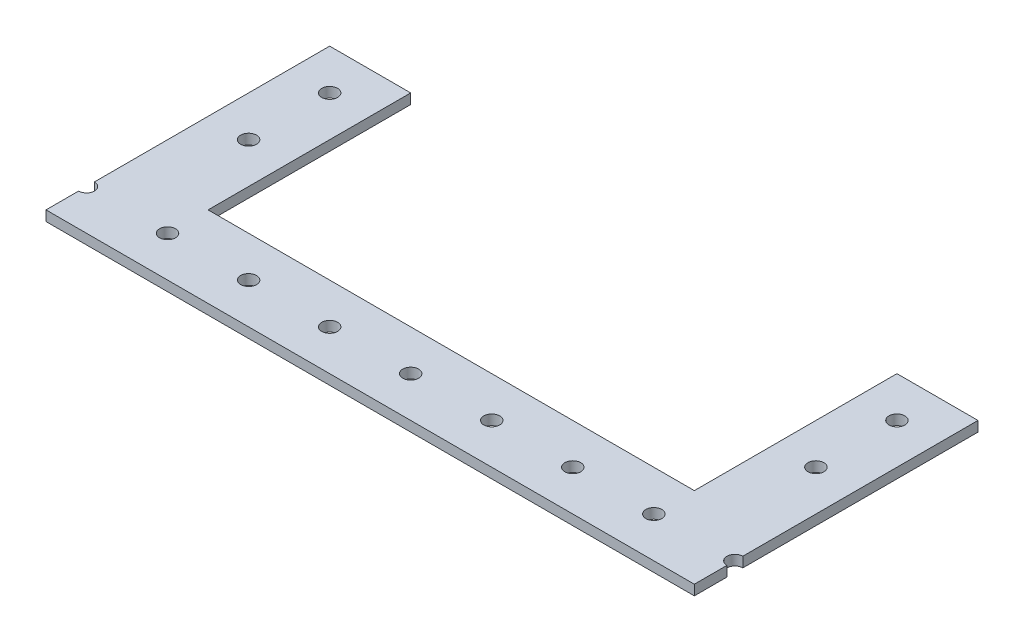
ISO-10303-21;
HEADER;
FILE_DESCRIPTION(('STEP AP214'),'2;1');
FILE_NAME('part.step','',(''),(''),'','','');
FILE_SCHEMA(('AUTOMOTIVE_DESIGN { 1 0 10303 214 1 1 1 1 }'));
ENDSEC;
DATA;
#1=APPLICATION_CONTEXT('core data for automotive mechanical design processes');
#2=APPLICATION_PROTOCOL_DEFINITION('international standard','automotive_design',2000,#1);
#3=PRODUCT_CONTEXT('',#1,'mechanical');
#4=PRODUCT('Part','Part','',(#3));
#5=PRODUCT_RELATED_PRODUCT_CATEGORY('part','',(#4));
#6=PRODUCT_DEFINITION_FORMATION('','',#4);
#7=PRODUCT_DEFINITION_CONTEXT('part definition',#1,'design');
#8=PRODUCT_DEFINITION('design','',#6,#7);
#9=PRODUCT_DEFINITION_SHAPE('','',#8);
#10=(LENGTH_UNIT() NAMED_UNIT(*) SI_UNIT(.MILLI.,.METRE.));
#11=(NAMED_UNIT(*) PLANE_ANGLE_UNIT() SI_UNIT($,.RADIAN.));
#12=(NAMED_UNIT(*) SI_UNIT($,.STERADIAN.) SOLID_ANGLE_UNIT());
#13=UNCERTAINTY_MEASURE_WITH_UNIT(LENGTH_MEASURE(1.E-05),#10,'distance_accuracy_value','');
#14=(GEOMETRIC_REPRESENTATION_CONTEXT(3) GLOBAL_UNCERTAINTY_ASSIGNED_CONTEXT((#13)) GLOBAL_UNIT_ASSIGNED_CONTEXT((#10,
#11,#12)) REPRESENTATION_CONTEXT('',''));
#15=CARTESIAN_POINT('',(0.,0.,0.));
#16=DIRECTION('',(0.,0.,1.));
#17=DIRECTION('',(1.,0.,0.));
#18=AXIS2_PLACEMENT_3D('',#15,#16,#17);
#19=CARTESIAN_POINT('',(101.6,3.175,-12.7));
#20=DIRECTION('',(0.,-1.,0.));
#21=DIRECTION('',(0.,0.,-1.));
#22=AXIS2_PLACEMENT_3D('',#19,#20,#21);
#23=CYLINDRICAL_SURFACE('',#22,2.48920000000003);
#24=CARTESIAN_POINT('',(101.6,0.,-12.7));
#25=DIRECTION('',(0.,1.,0.));
#26=DIRECTION('',(0.,0.,1.));
#27=AXIS2_PLACEMENT_3D('',#24,#25,#26);
#28=CIRCLE('',#27,2.48920000000003);
#29=CARTESIAN_POINT('',(101.6,0.,-15.1892));
#30=VERTEX_POINT('',#29);
#31=CARTESIAN_POINT('',(101.6,0.,-10.2108));
#32=VERTEX_POINT('',#31);
#33=EDGE_CURVE('E174',#30,#32,#28,.T.);
#34=ORIENTED_EDGE('',*,*,#33,.F.);
#35=DIRECTION('',(0.,-1.,0.));
#36=VECTOR('',#35,1.);
#37=CARTESIAN_POINT('',(101.6,3.175,-15.1892));
#38=LINE('',#37,#36);
#39=CARTESIAN_POINT('',(101.6,3.175,-15.1892));
#40=VERTEX_POINT('',#39);
#41=EDGE_CURVE('E11',#40,#30,#38,.T.);
#42=ORIENTED_EDGE('',*,*,#41,.F.);
#43=CARTESIAN_POINT('',(101.6,3.175,-12.7));
#44=DIRECTION('',(0.,1.,0.));
#45=DIRECTION('',(0.,0.,1.));
#46=AXIS2_PLACEMENT_3D('',#43,#44,#45);
#47=CIRCLE('',#46,2.48920000000003);
#48=CARTESIAN_POINT('',(101.6,3.175,-10.2108));
#49=VERTEX_POINT('',#48);
#50=EDGE_CURVE('E219',#40,#49,#47,.T.);
#51=ORIENTED_EDGE('',*,*,#50,.T.);
#52=DIRECTION('',(0.,-1.,0.));
#53=VECTOR('',#52,1.);
#54=CARTESIAN_POINT('',(101.6,3.175,-10.2108));
#55=LINE('',#54,#53);
#56=EDGE_CURVE('E97',#49,#32,#55,.T.);
#57=ORIENTED_EDGE('',*,*,#56,.T.);
#58=EDGE_LOOP('',(#34,#42,#51,#57));
#59=FACE_BOUND('',#58,.T.);
#60=ADVANCED_FACE('F34',(#59),#23,.F.);
#61=CARTESIAN_POINT('',(101.6,3.175,0.));
#62=DIRECTION('',(-1.,0.,0.));
#63=DIRECTION('',(0.,0.,1.));
#64=AXIS2_PLACEMENT_3D('',#61,#62,#63);
#65=PLANE('',#64);
#66=DIRECTION('',(0.,0.,-1.));
#67=VECTOR('',#66,1.);
#68=CARTESIAN_POINT('',(101.6,0.,0.));
#69=LINE('',#68,#67);
#70=CARTESIAN_POINT('',(101.6,0.,-88.9));
#71=VERTEX_POINT('',#70);
#72=EDGE_CURVE('E177',#30,#71,#69,.T.);
#73=ORIENTED_EDGE('',*,*,#72,.T.);
#74=DIRECTION('',(0.,-1.,0.));
#75=VECTOR('',#74,1.);
#76=CARTESIAN_POINT('',(101.6,3.175,-88.9));
#77=LINE('',#76,#75);
#78=CARTESIAN_POINT('',(101.6,3.175,-88.9));
#79=VERTEX_POINT('',#78);
#80=EDGE_CURVE('E42',#79,#71,#77,.T.);
#81=ORIENTED_EDGE('',*,*,#80,.F.);
#82=DIRECTION('',(0.,0.,-1.));
#83=VECTOR('',#82,1.);
#84=CARTESIAN_POINT('',(101.6,3.175,0.));
#85=LINE('',#84,#83);
#86=EDGE_CURVE('E151',#40,#79,#85,.T.);
#87=ORIENTED_EDGE('',*,*,#86,.F.);
#88=ORIENTED_EDGE('',*,*,#41,.T.);
#89=EDGE_LOOP('',(#73,#81,#87,#88));
#90=FACE_BOUND('',#89,.T.);
#91=ADVANCED_FACE('F286',(#90),#65,.F.);
#92=CARTESIAN_POINT('',(0.,3.175,-88.9));
#93=DIRECTION('',(0.,0.,1.));
#94=DIRECTION('',(1.,0.,0.));
#95=AXIS2_PLACEMENT_3D('',#92,#93,#94);
#96=PLANE('',#95);
#97=DIRECTION('',(-1.,0.,0.));
#98=VECTOR('',#97,1.);
#99=CARTESIAN_POINT('',(0.,0.,-88.9));
#100=LINE('',#99,#98);
#101=CARTESIAN_POINT('',(76.2,0.,-88.9));
#102=VERTEX_POINT('',#101);
#103=EDGE_CURVE('E180',#71,#102,#100,.T.);
#104=ORIENTED_EDGE('',*,*,#103,.T.);
#105=DIRECTION('',(0.,-1.,0.));
#106=VECTOR('',#105,1.);
#107=CARTESIAN_POINT('',(76.2,3.175,-88.9));
#108=LINE('',#107,#106);
#109=CARTESIAN_POINT('',(76.2,3.175,-88.9));
#110=VERTEX_POINT('',#109);
#111=EDGE_CURVE('E237',#110,#102,#108,.T.);
#112=ORIENTED_EDGE('',*,*,#111,.F.);
#113=DIRECTION('',(-1.,0.,0.));
#114=VECTOR('',#113,1.);
#115=CARTESIAN_POINT('',(0.,3.175,-88.9));
#116=LINE('',#115,#114);
#117=EDGE_CURVE('E246',#79,#110,#116,.T.);
#118=ORIENTED_EDGE('',*,*,#117,.F.);
#119=ORIENTED_EDGE('',*,*,#80,.T.);
#120=EDGE_LOOP('',(#104,#112,#118,#119));
#121=FACE_BOUND('',#120,.T.);
#122=ADVANCED_FACE('F244',(#121),#96,.F.);
#123=CARTESIAN_POINT('',(76.2,3.175,0.));
#124=DIRECTION('',(1.,0.,0.));
#125=DIRECTION('',(0.,0.,-1.));
#126=AXIS2_PLACEMENT_3D('',#123,#124,#125);
#127=PLANE('',#126);
#128=DIRECTION('',(0.,0.,1.));
#129=VECTOR('',#128,1.);
#130=CARTESIAN_POINT('',(76.2,0.,0.));
#131=LINE('',#130,#129);
#132=CARTESIAN_POINT('',(76.2,0.,-25.4));
#133=VERTEX_POINT('',#132);
#134=EDGE_CURVE('E183',#102,#133,#131,.T.);
#135=ORIENTED_EDGE('',*,*,#134,.T.);
#136=DIRECTION('',(0.,-1.,0.));
#137=VECTOR('',#136,1.);
#138=CARTESIAN_POINT('',(76.2,3.175,-25.4));
#139=LINE('',#138,#137);
#140=CARTESIAN_POINT('',(76.2,3.175,-25.4));
#141=VERTEX_POINT('',#140);
#142=EDGE_CURVE('E234',#141,#133,#139,.T.);
#143=ORIENTED_EDGE('',*,*,#142,.F.);
#144=DIRECTION('',(0.,0.,1.));
#145=VECTOR('',#144,1.);
#146=CARTESIAN_POINT('',(76.2,3.175,0.));
#147=LINE('',#146,#145);
#148=EDGE_CURVE('E266',#110,#141,#147,.T.);
#149=ORIENTED_EDGE('',*,*,#148,.F.);
#150=ORIENTED_EDGE('',*,*,#111,.T.);
#151=EDGE_LOOP('',(#135,#143,#149,#150));
#152=FACE_BOUND('',#151,.T.);
#153=ADVANCED_FACE('F257',(#152),#127,.F.);
#154=CARTESIAN_POINT('',(0.,3.175,-25.4));
#155=DIRECTION('',(0.,0.,1.));
#156=DIRECTION('',(1.,0.,0.));
#157=AXIS2_PLACEMENT_3D('',#154,#155,#156);
#158=PLANE('',#157);
#159=DIRECTION('',(-1.,0.,0.));
#160=VECTOR('',#159,1.);
#161=CARTESIAN_POINT('',(0.,0.,-25.4));
#162=LINE('',#161,#160);
#163=CARTESIAN_POINT('',(-76.2,0.,-25.4));
#164=VERTEX_POINT('',#163);
#165=EDGE_CURVE('E185',#133,#164,#162,.T.);
#166=ORIENTED_EDGE('',*,*,#165,.T.);
#167=DIRECTION('',(0.,-1.,0.));
#168=VECTOR('',#167,1.);
#169=CARTESIAN_POINT('',(-76.2,3.175,-25.4));
#170=LINE('',#169,#168);
#171=CARTESIAN_POINT('',(-76.2,3.175,-25.4));
#172=VERTEX_POINT('',#171);
#173=EDGE_CURVE('E231',#172,#164,#170,.T.);
#174=ORIENTED_EDGE('',*,*,#173,.F.);
#175=DIRECTION('',(-1.,0.,0.));
#176=VECTOR('',#175,1.);
#177=CARTESIAN_POINT('',(0.,3.175,-25.4));
#178=LINE('',#177,#176);
#179=EDGE_CURVE('E263',#141,#172,#178,.T.);
#180=ORIENTED_EDGE('',*,*,#179,.F.);
#181=ORIENTED_EDGE('',*,*,#142,.T.);
#182=EDGE_LOOP('',(#166,#174,#180,#181));
#183=FACE_BOUND('',#182,.T.);
#184=ADVANCED_FACE('F261',(#183),#158,.F.);
#185=CARTESIAN_POINT('',(-76.2,3.175,0.));
#186=DIRECTION('',(-1.,0.,0.));
#187=DIRECTION('',(0.,0.,1.));
#188=AXIS2_PLACEMENT_3D('',#185,#186,#187);
#189=PLANE('',#188);
#190=DIRECTION('',(0.,0.,-1.));
#191=VECTOR('',#190,1.);
#192=CARTESIAN_POINT('',(-76.2,0.,0.));
#193=LINE('',#192,#191);
#194=CARTESIAN_POINT('',(-76.2,0.,-88.9));
#195=VERTEX_POINT('',#194);
#196=EDGE_CURVE('E187',#164,#195,#193,.T.);
#197=ORIENTED_EDGE('',*,*,#196,.T.);
#198=DIRECTION('',(0.,-1.,0.));
#199=VECTOR('',#198,1.);
#200=CARTESIAN_POINT('',(-76.2,3.175,-88.9));
#201=LINE('',#200,#199);
#202=CARTESIAN_POINT('',(-76.2,3.175,-88.9));
#203=VERTEX_POINT('',#202);
#204=EDGE_CURVE('E228',#203,#195,#201,.T.);
#205=ORIENTED_EDGE('',*,*,#204,.F.);
#206=DIRECTION('',(0.,0.,-1.));
#207=VECTOR('',#206,1.);
#208=CARTESIAN_POINT('',(-76.2,3.175,0.));
#209=LINE('',#208,#207);
#210=EDGE_CURVE('E265',#172,#203,#209,.T.);
#211=ORIENTED_EDGE('',*,*,#210,.F.);
#212=ORIENTED_EDGE('',*,*,#173,.T.);
#213=EDGE_LOOP('',(#197,#205,#211,#212));
#214=FACE_BOUND('',#213,.T.);
#215=ADVANCED_FACE('F495',(#214),#189,.F.);
#216=CARTESIAN_POINT('',(0.,3.175,-88.9));
#217=DIRECTION('',(0.,0.,1.));
#218=DIRECTION('',(1.,0.,0.));
#219=AXIS2_PLACEMENT_3D('',#216,#217,#218);
#220=PLANE('',#219);
#221=DIRECTION('',(-1.,0.,0.));
#222=VECTOR('',#221,1.);
#223=CARTESIAN_POINT('',(0.,0.,-88.9));
#224=LINE('',#223,#222);
#225=CARTESIAN_POINT('',(-101.6,0.,-88.9));
#226=VERTEX_POINT('',#225);
#227=EDGE_CURVE('E189',#195,#226,#224,.T.);
#228=ORIENTED_EDGE('',*,*,#227,.T.);
#229=DIRECTION('',(0.,-1.,0.));
#230=VECTOR('',#229,1.);
#231=CARTESIAN_POINT('',(-101.6,3.175,-88.9));
#232=LINE('',#231,#230);
#233=CARTESIAN_POINT('',(-101.6,3.175,-88.9));
#234=VERTEX_POINT('',#233);
#235=EDGE_CURVE('E225',#234,#226,#232,.T.);
#236=ORIENTED_EDGE('',*,*,#235,.F.);
#237=DIRECTION('',(-1.,0.,0.));
#238=VECTOR('',#237,1.);
#239=CARTESIAN_POINT('',(0.,3.175,-88.9));
#240=LINE('',#239,#238);
#241=EDGE_CURVE('E268',#203,#234,#240,.T.);
#242=ORIENTED_EDGE('',*,*,#241,.F.);
#243=ORIENTED_EDGE('',*,*,#204,.T.);
#244=EDGE_LOOP('',(#228,#236,#242,#243));
#245=FACE_BOUND('',#244,.T.);
#246=ADVANCED_FACE('F487',(#245),#220,.F.);
#247=CARTESIAN_POINT('',(-101.6,3.175,0.));
#248=DIRECTION('',(1.,0.,0.));
#249=DIRECTION('',(0.,0.,-1.));
#250=AXIS2_PLACEMENT_3D('',#247,#248,#249);
#251=PLANE('',#250);
#252=DIRECTION('',(0.,0.,1.));
#253=VECTOR('',#252,1.);
#254=CARTESIAN_POINT('',(-101.6,0.,0.));
#255=LINE('',#254,#253);
#256=CARTESIAN_POINT('',(-101.6,0.,-15.1892));
#257=VERTEX_POINT('',#256);
#258=EDGE_CURVE('E191',#226,#257,#255,.T.);
#259=ORIENTED_EDGE('',*,*,#258,.T.);
#260=DIRECTION('',(0.,-1.,0.));
#261=VECTOR('',#260,1.);
#262=CARTESIAN_POINT('',(-101.6,3.175,-15.1892));
#263=LINE('',#262,#261);
#264=CARTESIAN_POINT('',(-101.6,3.175,-15.1892));
#265=VERTEX_POINT('',#264);
#266=EDGE_CURVE('E223',#265,#257,#263,.T.);
#267=ORIENTED_EDGE('',*,*,#266,.F.);
#268=DIRECTION('',(0.,0.,1.));
#269=VECTOR('',#268,1.);
#270=CARTESIAN_POINT('',(-101.6,3.175,0.));
#271=LINE('',#270,#269);
#272=EDGE_CURVE('E139',#234,#265,#271,.T.);
#273=ORIENTED_EDGE('',*,*,#272,.F.);
#274=ORIENTED_EDGE('',*,*,#235,.T.);
#275=EDGE_LOOP('',(#259,#267,#273,#274));
#276=FACE_BOUND('',#275,.T.);
#277=ADVANCED_FACE('F473',(#276),#251,.F.);
#278=CARTESIAN_POINT('',(-101.6,3.175,-12.7));
#279=DIRECTION('',(0.,-1.,0.));
#280=DIRECTION('',(0.,0.,-1.));
#281=AXIS2_PLACEMENT_3D('',#278,#279,#280);
#282=CYLINDRICAL_SURFACE('',#281,2.48920000000003);
#283=CARTESIAN_POINT('',(-101.6,0.,-12.7));
#284=DIRECTION('',(0.,1.,0.));
#285=DIRECTION('',(0.,0.,1.));
#286=AXIS2_PLACEMENT_3D('',#283,#284,#285);
#287=CIRCLE('',#286,2.48920000000003);
#288=CARTESIAN_POINT('',(-101.6,0.,-10.2108));
#289=VERTEX_POINT('',#288);
#290=EDGE_CURVE('E194',#289,#257,#287,.T.);
#291=ORIENTED_EDGE('',*,*,#290,.F.);
#292=DIRECTION('',(0.,-1.,0.));
#293=VECTOR('',#292,1.);
#294=CARTESIAN_POINT('',(-101.6,3.175,-10.2108));
#295=LINE('',#294,#293);
#296=CARTESIAN_POINT('',(-101.6,3.175,-10.2108));
#297=VERTEX_POINT('',#296);
#298=EDGE_CURVE('E144',#297,#289,#295,.T.);
#299=ORIENTED_EDGE('',*,*,#298,.F.);
#300=CARTESIAN_POINT('',(-101.6,3.175,-12.7));
#301=DIRECTION('',(0.,1.,0.));
#302=DIRECTION('',(0.,0.,1.));
#303=AXIS2_PLACEMENT_3D('',#300,#301,#302);
#304=CIRCLE('',#303,2.48920000000003);
#305=EDGE_CURVE('E136',#297,#265,#304,.T.);
#306=ORIENTED_EDGE('',*,*,#305,.T.);
#307=ORIENTED_EDGE('',*,*,#266,.T.);
#308=EDGE_LOOP('',(#291,#299,#306,#307));
#309=FACE_BOUND('',#308,.T.);
#310=ADVANCED_FACE('F277',(#309),#282,.F.);
#311=CARTESIAN_POINT('',(-101.6,0.,0.));
#312=VERTEX_POINT('',#311);
#313=EDGE_CURVE('E143',#289,#312,#255,.T.);
#314=ORIENTED_EDGE('',*,*,#313,.T.);
#315=DIRECTION('',(0.,-1.,0.));
#316=VECTOR('',#315,1.);
#317=CARTESIAN_POINT('',(-101.6,3.175,0.));
#318=LINE('',#317,#316);
#319=CARTESIAN_POINT('',(-101.6,3.175,0.));
#320=VERTEX_POINT('',#319);
#321=EDGE_CURVE('E140',#320,#312,#318,.T.);
#322=ORIENTED_EDGE('',*,*,#321,.F.);
#323=EDGE_CURVE('E129',#297,#320,#271,.T.);
#324=ORIENTED_EDGE('',*,*,#323,.F.);
#325=ORIENTED_EDGE('',*,*,#298,.T.);
#326=EDGE_LOOP('',(#314,#322,#324,#325));
#327=FACE_BOUND('',#326,.T.);
#328=ADVANCED_FACE('F141',(#327),#251,.F.);
#329=CARTESIAN_POINT('',(0.,3.175,0.));
#330=DIRECTION('',(0.,0.,-1.));
#331=DIRECTION('',(-1.,0.,0.));
#332=AXIS2_PLACEMENT_3D('',#329,#330,#331);
#333=PLANE('',#332);
#334=DIRECTION('',(1.,0.,0.));
#335=VECTOR('',#334,1.);
#336=CARTESIAN_POINT('',(0.,0.,0.));
#337=LINE('',#336,#335);
#338=CARTESIAN_POINT('',(101.6,0.,0.));
#339=VERTEX_POINT('',#338);
#340=EDGE_CURVE('E90',#312,#339,#337,.T.);
#341=ORIENTED_EDGE('',*,*,#340,.T.);
#342=DIRECTION('',(0.,-1.,0.));
#343=VECTOR('',#342,1.);
#344=CARTESIAN_POINT('',(101.6,3.175,0.));
#345=LINE('',#344,#343);
#346=CARTESIAN_POINT('',(101.6,3.175,0.));
#347=VERTEX_POINT('',#346);
#348=EDGE_CURVE('E145',#347,#339,#345,.T.);
#349=ORIENTED_EDGE('',*,*,#348,.F.);
#350=DIRECTION('',(1.,0.,0.));
#351=VECTOR('',#350,1.);
#352=CARTESIAN_POINT('',(0.,3.175,0.));
#353=LINE('',#352,#351);
#354=EDGE_CURVE('E134',#320,#347,#353,.T.);
#355=ORIENTED_EDGE('',*,*,#354,.F.);
#356=ORIENTED_EDGE('',*,*,#321,.T.);
#357=EDGE_LOOP('',(#341,#349,#355,#356));
#358=FACE_BOUND('',#357,.T.);
#359=ADVANCED_FACE('F147',(#358),#333,.F.);
#360=CARTESIAN_POINT('',(-50.8,3.175,-12.7));
#361=DIRECTION('',(0.,-1.,0.));
#362=DIRECTION('',(0.,0.,-1.));
#363=AXIS2_PLACEMENT_3D('',#360,#361,#362);
#364=CYLINDRICAL_SURFACE('',#363,2.4892);
#365=CARTESIAN_POINT('',(-50.8,3.175,-12.7));
#366=DIRECTION('',(0.,1.,0.));
#367=DIRECTION('',(0.,0.,1.));
#368=AXIS2_PLACEMENT_3D('',#365,#366,#367);
#369=CIRCLE('',#368,2.4892);
#370=CARTESIAN_POINT('',(-50.8,3.175,-10.2108));
#371=VERTEX_POINT('',#370);
#372=EDGE_CURVE('E168',#371,#371,#369,.T.);
#373=ORIENTED_EDGE('',*,*,#372,.T.);
#374=EDGE_LOOP('',(#373));
#375=FACE_BOUND('',#374,.T.);
#376=CARTESIAN_POINT('',(-50.8,0.,-12.7));
#377=DIRECTION('',(0.,1.,0.));
#378=DIRECTION('',(0.,0.,1.));
#379=AXIS2_PLACEMENT_3D('',#376,#377,#378);
#380=CIRCLE('',#379,2.4892);
#381=CARTESIAN_POINT('',(-50.8,0.,-10.2108));
#382=VERTEX_POINT('',#381);
#383=EDGE_CURVE('E213',#382,#382,#380,.T.);
#384=ORIENTED_EDGE('',*,*,#383,.F.);
#385=EDGE_LOOP('',(#384));
#386=FACE_BOUND('',#385,.T.);
#387=ADVANCED_FACE('F324',(#375,#386),#364,.F.);
#388=CARTESIAN_POINT('',(-25.4,3.175,-12.7));
#389=DIRECTION('',(0.,-1.,0.));
#390=DIRECTION('',(0.,0.,-1.));
#391=AXIS2_PLACEMENT_3D('',#388,#389,#390);
#392=CYLINDRICAL_SURFACE('',#391,2.4892);
#393=CARTESIAN_POINT('',(-25.4,3.175,-12.7));
#394=DIRECTION('',(0.,1.,0.));
#395=DIRECTION('',(0.,0.,1.));
#396=AXIS2_PLACEMENT_3D('',#393,#394,#395);
#397=CIRCLE('',#396,2.4892);
#398=CARTESIAN_POINT('',(-25.4,3.175,-10.2108));
#399=VERTEX_POINT('',#398);
#400=EDGE_CURVE('E165',#399,#399,#397,.T.);
#401=ORIENTED_EDGE('',*,*,#400,.T.);
#402=EDGE_LOOP('',(#401));
#403=FACE_BOUND('',#402,.T.);
#404=CARTESIAN_POINT('',(-25.4,0.,-12.7));
#405=DIRECTION('',(0.,1.,0.));
#406=DIRECTION('',(0.,0.,1.));
#407=AXIS2_PLACEMENT_3D('',#404,#405,#406);
#408=CIRCLE('',#407,2.4892);
#409=CARTESIAN_POINT('',(-25.4,0.,-10.2108));
#410=VERTEX_POINT('',#409);
#411=EDGE_CURVE('E210',#410,#410,#408,.T.);
#412=ORIENTED_EDGE('',*,*,#411,.F.);
#413=EDGE_LOOP('',(#412));
#414=FACE_BOUND('',#413,.T.);
#415=ADVANCED_FACE('F320',(#403,#414),#392,.F.);
#416=CARTESIAN_POINT('',(0.,3.175,-12.7));
#417=DIRECTION('',(0.,-1.,0.));
#418=DIRECTION('',(0.,0.,-1.));
#419=AXIS2_PLACEMENT_3D('',#416,#417,#418);
#420=CYLINDRICAL_SURFACE('',#419,2.4892);
#421=CARTESIAN_POINT('',(0.,3.175,-12.7));
#422=DIRECTION('',(0.,1.,0.));
#423=DIRECTION('',(0.,0.,1.));
#424=AXIS2_PLACEMENT_3D('',#421,#422,#423);
#425=CIRCLE('',#424,2.4892);
#426=CARTESIAN_POINT('',(0.,3.175,-10.2108));
#427=VERTEX_POINT('',#426);
#428=EDGE_CURVE('E162',#427,#427,#425,.T.);
#429=ORIENTED_EDGE('',*,*,#428,.T.);
#430=EDGE_LOOP('',(#429));
#431=FACE_BOUND('',#430,.T.);
#432=CARTESIAN_POINT('',(0.,0.,-12.7));
#433=DIRECTION('',(0.,1.,0.));
#434=DIRECTION('',(0.,0.,1.));
#435=AXIS2_PLACEMENT_3D('',#432,#433,#434);
#436=CIRCLE('',#435,2.4892);
#437=CARTESIAN_POINT('',(0.,0.,-10.2108));
#438=VERTEX_POINT('',#437);
#439=EDGE_CURVE('E207',#438,#438,#436,.T.);
#440=ORIENTED_EDGE('',*,*,#439,.F.);
#441=EDGE_LOOP('',(#440));
#442=FACE_BOUND('',#441,.T.);
#443=ADVANCED_FACE('F316',(#431,#442),#420,.F.);
#444=CARTESIAN_POINT('',(25.4,3.175,-12.7));
#445=DIRECTION('',(0.,-1.,0.));
#446=DIRECTION('',(0.,0.,-1.));
#447=AXIS2_PLACEMENT_3D('',#444,#445,#446);
#448=CYLINDRICAL_SURFACE('',#447,2.4892);
#449=CARTESIAN_POINT('',(25.4,3.175,-12.7));
#450=DIRECTION('',(0.,1.,0.));
#451=DIRECTION('',(0.,0.,1.));
#452=AXIS2_PLACEMENT_3D('',#449,#450,#451);
#453=CIRCLE('',#452,2.4892);
#454=CARTESIAN_POINT('',(25.4,3.175,-10.2108));
#455=VERTEX_POINT('',#454);
#456=EDGE_CURVE('E159',#455,#455,#453,.T.);
#457=ORIENTED_EDGE('',*,*,#456,.T.);
#458=EDGE_LOOP('',(#457));
#459=FACE_BOUND('',#458,.T.);
#460=CARTESIAN_POINT('',(25.4,0.,-12.7));
#461=DIRECTION('',(0.,1.,0.));
#462=DIRECTION('',(0.,0.,1.));
#463=AXIS2_PLACEMENT_3D('',#460,#461,#462);
#464=CIRCLE('',#463,2.4892);
#465=CARTESIAN_POINT('',(25.4,0.,-10.2108));
#466=VERTEX_POINT('',#465);
#467=EDGE_CURVE('E204',#466,#466,#464,.T.);
#468=ORIENTED_EDGE('',*,*,#467,.F.);
#469=EDGE_LOOP('',(#468));
#470=FACE_BOUND('',#469,.T.);
#471=ADVANCED_FACE('F309',(#459,#470),#448,.F.);
#472=CARTESIAN_POINT('',(50.7999999999999,3.175,-12.7));
#473=DIRECTION('',(0.,-1.,0.));
#474=DIRECTION('',(0.,0.,-1.));
#475=AXIS2_PLACEMENT_3D('',#472,#473,#474);
#476=CYLINDRICAL_SURFACE('',#475,2.48920000000002);
#477=CARTESIAN_POINT('',(50.7999999999999,3.175,-12.7));
#478=DIRECTION('',(0.,1.,0.));
#479=DIRECTION('',(0.,0.,1.));
#480=AXIS2_PLACEMENT_3D('',#477,#478,#479);
#481=CIRCLE('',#480,2.48920000000002);
#482=CARTESIAN_POINT('',(50.7999999999999,3.175,-10.2108));
#483=VERTEX_POINT('',#482);
#484=EDGE_CURVE('E156',#483,#483,#481,.T.);
#485=ORIENTED_EDGE('',*,*,#484,.T.);
#486=EDGE_LOOP('',(#485));
#487=FACE_BOUND('',#486,.T.);
#488=CARTESIAN_POINT('',(50.7999999999999,0.,-12.7));
#489=DIRECTION('',(0.,1.,0.));
#490=DIRECTION('',(0.,0.,1.));
#491=AXIS2_PLACEMENT_3D('',#488,#489,#490);
#492=CIRCLE('',#491,2.48920000000002);
#493=CARTESIAN_POINT('',(50.7999999999999,0.,-10.2108));
#494=VERTEX_POINT('',#493);
#495=EDGE_CURVE('E201',#494,#494,#492,.T.);
#496=ORIENTED_EDGE('',*,*,#495,.F.);
#497=EDGE_LOOP('',(#496));
#498=FACE_BOUND('',#497,.T.);
#499=ADVANCED_FACE('F304',(#487,#498),#476,.F.);
#500=CARTESIAN_POINT('',(76.1999999999999,3.175,-12.7));
#501=DIRECTION('',(0.,-1.,0.));
#502=DIRECTION('',(0.,0.,-1.));
#503=AXIS2_PLACEMENT_3D('',#500,#501,#502);
#504=CYLINDRICAL_SURFACE('',#503,2.4892);
#505=CARTESIAN_POINT('',(76.1999999999999,3.175,-12.7));
#506=DIRECTION('',(0.,1.,0.));
#507=DIRECTION('',(0.,0.,1.));
#508=AXIS2_PLACEMENT_3D('',#505,#506,#507);
#509=CIRCLE('',#508,2.4892);
#510=CARTESIAN_POINT('',(76.1999999999999,3.175,-10.2108));
#511=VERTEX_POINT('',#510);
#512=EDGE_CURVE('E149',#511,#511,#509,.T.);
#513=ORIENTED_EDGE('',*,*,#512,.T.);
#514=EDGE_LOOP('',(#513));
#515=FACE_BOUND('',#514,.T.);
#516=CARTESIAN_POINT('',(76.1999999999999,0.,-12.7));
#517=DIRECTION('',(0.,1.,0.));
#518=DIRECTION('',(0.,0.,1.));
#519=AXIS2_PLACEMENT_3D('',#516,#517,#518);
#520=CIRCLE('',#519,2.4892);
#521=CARTESIAN_POINT('',(76.1999999999999,0.,-10.2108));
#522=VERTEX_POINT('',#521);
#523=EDGE_CURVE('E198',#522,#522,#520,.T.);
#524=ORIENTED_EDGE('',*,*,#523,.F.);
#525=EDGE_LOOP('',(#524));
#526=FACE_BOUND('',#525,.T.);
#527=ADVANCED_FACE('F297',(#515,#526),#504,.F.);
#528=EDGE_CURVE('E181',#339,#32,#69,.T.);
#529=ORIENTED_EDGE('',*,*,#528,.T.);
#530=ORIENTED_EDGE('',*,*,#56,.F.);
#531=EDGE_CURVE('E50',#347,#49,#85,.T.);
#532=ORIENTED_EDGE('',*,*,#531,.F.);
#533=ORIENTED_EDGE('',*,*,#348,.T.);
#534=EDGE_LOOP('',(#529,#530,#532,#533));
#535=FACE_BOUND('',#534,.T.);
#536=ADVANCED_FACE('F281',(#535),#65,.F.);
#537=CARTESIAN_POINT('',(-76.2,3.175,-12.7));
#538=DIRECTION('',(0.,-1.,0.));
#539=DIRECTION('',(0.,0.,-1.));
#540=AXIS2_PLACEMENT_3D('',#537,#538,#539);
#541=CYLINDRICAL_SURFACE('',#540,2.4892);
#542=CARTESIAN_POINT('',(-76.2,3.175,-12.7));
#543=DIRECTION('',(0.,1.,0.));
#544=DIRECTION('',(0.,0.,1.));
#545=AXIS2_PLACEMENT_3D('',#542,#543,#544);
#546=CIRCLE('',#545,2.4892);
#547=CARTESIAN_POINT('',(-76.2,3.175,-10.2108));
#548=VERTEX_POINT('',#547);
#549=EDGE_CURVE('E171',#548,#548,#546,.T.);
#550=ORIENTED_EDGE('',*,*,#549,.T.);
#551=EDGE_LOOP('',(#550));
#552=FACE_BOUND('',#551,.T.);
#553=CARTESIAN_POINT('',(-76.2,0.,-12.7));
#554=DIRECTION('',(0.,1.,0.));
#555=DIRECTION('',(0.,0.,1.));
#556=AXIS2_PLACEMENT_3D('',#553,#554,#555);
#557=CIRCLE('',#556,2.4892);
#558=CARTESIAN_POINT('',(-76.2,0.,-10.2108));
#559=VERTEX_POINT('',#558);
#560=EDGE_CURVE('E216',#559,#559,#557,.T.);
#561=ORIENTED_EDGE('',*,*,#560,.F.);
#562=EDGE_LOOP('',(#561));
#563=FACE_BOUND('',#562,.T.);
#564=ADVANCED_FACE('F296',(#552,#563),#541,.F.);
#565=CARTESIAN_POINT('',(0.,3.175,0.));
#566=DIRECTION('',(0.,1.,0.));
#567=DIRECTION('',(0.,0.,1.));
#568=AXIS2_PLACEMENT_3D('',#565,#566,#567);
#569=PLANE('',#568);
#570=CARTESIAN_POINT('',(88.9,3.175,-50.8));
#571=DIRECTION('',(0.,1.,0.));
#572=DIRECTION('',(0.,0.,1.));
#573=AXIS2_PLACEMENT_3D('',#570,#571,#572);
#574=CIRCLE('',#573,2.48920000000005);
#575=CARTESIAN_POINT('',(88.9,3.175,-48.3107999999999));
#576=VERTEX_POINT('',#575);
#577=EDGE_CURVE('E372',#576,#576,#574,.T.);
#578=ORIENTED_EDGE('',*,*,#577,.F.);
#579=EDGE_LOOP('',(#578));
#580=FACE_BOUND('',#579,.T.);
#581=CARTESIAN_POINT('',(88.9,3.175,-76.2));
#582=DIRECTION('',(0.,1.,0.));
#583=DIRECTION('',(0.,0.,1.));
#584=AXIS2_PLACEMENT_3D('',#581,#582,#583);
#585=CIRCLE('',#584,2.48920000000005);
#586=CARTESIAN_POINT('',(88.9,3.175,-73.7107999999999));
#587=VERTEX_POINT('',#586);
#588=EDGE_CURVE('E364',#587,#587,#585,.T.);
#589=ORIENTED_EDGE('',*,*,#588,.F.);
#590=EDGE_LOOP('',(#589));
#591=FACE_BOUND('',#590,.T.);
#592=CARTESIAN_POINT('',(-88.9,3.175,-76.2));
#593=DIRECTION('',(0.,1.,0.));
#594=DIRECTION('',(0.,0.,1.));
#595=AXIS2_PLACEMENT_3D('',#592,#593,#594);
#596=CIRCLE('',#595,2.4892);
#597=CARTESIAN_POINT('',(-88.9,3.175,-73.7108));
#598=VERTEX_POINT('',#597);
#599=EDGE_CURVE('E358',#598,#598,#596,.T.);
#600=ORIENTED_EDGE('',*,*,#599,.F.);
#601=EDGE_LOOP('',(#600));
#602=FACE_BOUND('',#601,.T.);
#603=CARTESIAN_POINT('',(-88.9,3.175,-50.7999999999999));
#604=DIRECTION('',(0.,1.,0.));
#605=DIRECTION('',(0.,0.,1.));
#606=AXIS2_PLACEMENT_3D('',#603,#604,#605);
#607=CIRCLE('',#606,2.4892);
#608=CARTESIAN_POINT('',(-88.9,3.175,-48.3107999999999));
#609=VERTEX_POINT('',#608);
#610=EDGE_CURVE('E284',#609,#609,#607,.T.);
#611=ORIENTED_EDGE('',*,*,#610,.F.);
#612=EDGE_LOOP('',(#611));
#613=FACE_BOUND('',#612,.T.);
#614=ORIENTED_EDGE('',*,*,#50,.F.);
#615=ORIENTED_EDGE('',*,*,#86,.T.);
#616=ORIENTED_EDGE('',*,*,#117,.T.);
#617=ORIENTED_EDGE('',*,*,#148,.T.);
#618=ORIENTED_EDGE('',*,*,#179,.T.);
#619=ORIENTED_EDGE('',*,*,#210,.T.);
#620=ORIENTED_EDGE('',*,*,#241,.T.);
#621=ORIENTED_EDGE('',*,*,#272,.T.);
#622=ORIENTED_EDGE('',*,*,#305,.F.);
#623=ORIENTED_EDGE('',*,*,#323,.T.);
#624=ORIENTED_EDGE('',*,*,#354,.T.);
#625=ORIENTED_EDGE('',*,*,#531,.T.);
#626=EDGE_LOOP('',(#614,#615,#616,#617,#618,#619,#620,#621,#622,#623,#624,#625));
#627=FACE_BOUND('',#626,.T.);
#628=ORIENTED_EDGE('',*,*,#512,.F.);
#629=EDGE_LOOP('',(#628));
#630=FACE_BOUND('',#629,.T.);
#631=ORIENTED_EDGE('',*,*,#484,.F.);
#632=EDGE_LOOP('',(#631));
#633=FACE_BOUND('',#632,.T.);
#634=ORIENTED_EDGE('',*,*,#456,.F.);
#635=EDGE_LOOP('',(#634));
#636=FACE_BOUND('',#635,.T.);
#637=ORIENTED_EDGE('',*,*,#428,.F.);
#638=EDGE_LOOP('',(#637));
#639=FACE_BOUND('',#638,.T.);
#640=ORIENTED_EDGE('',*,*,#400,.F.);
#641=EDGE_LOOP('',(#640));
#642=FACE_BOUND('',#641,.T.);
#643=ORIENTED_EDGE('',*,*,#372,.F.);
#644=EDGE_LOOP('',(#643));
#645=FACE_BOUND('',#644,.T.);
#646=ORIENTED_EDGE('',*,*,#549,.F.);
#647=EDGE_LOOP('',(#646));
#648=FACE_BOUND('',#647,.T.);
#649=ADVANCED_FACE('F131',(#580,#591,#602,#613,#627,#630,#633,#636,#639,#642,#645,#648),#569,.T.);
#650=CARTESIAN_POINT('',(0.,0.,0.));
#651=DIRECTION('',(0.,1.,0.));
#652=DIRECTION('',(0.,0.,1.));
#653=AXIS2_PLACEMENT_3D('',#650,#651,#652);
#654=PLANE('',#653);
#655=CARTESIAN_POINT('',(88.9,0.,-50.8));
#656=DIRECTION('',(0.,1.,0.));
#657=DIRECTION('',(0.,0.,1.));
#658=AXIS2_PLACEMENT_3D('',#655,#656,#657);
#659=CIRCLE('',#658,2.48920000000005);
#660=CARTESIAN_POINT('',(88.9,0.,-48.3107999999999));
#661=VERTEX_POINT('',#660);
#662=EDGE_CURVE('E369',#661,#661,#659,.T.);
#663=ORIENTED_EDGE('',*,*,#662,.T.);
#664=EDGE_LOOP('',(#663));
#665=FACE_BOUND('',#664,.T.);
#666=CARTESIAN_POINT('',(88.9,0.,-76.2));
#667=DIRECTION('',(0.,1.,0.));
#668=DIRECTION('',(0.,0.,1.));
#669=AXIS2_PLACEMENT_3D('',#666,#667,#668);
#670=CIRCLE('',#669,2.48920000000005);
#671=CARTESIAN_POINT('',(88.9,0.,-73.7107999999999));
#672=VERTEX_POINT('',#671);
#673=EDGE_CURVE('E360',#672,#672,#670,.T.);
#674=ORIENTED_EDGE('',*,*,#673,.T.);
#675=EDGE_LOOP('',(#674));
#676=FACE_BOUND('',#675,.T.);
#677=CARTESIAN_POINT('',(-88.9,0.,-76.2));
#678=DIRECTION('',(0.,1.,0.));
#679=DIRECTION('',(0.,0.,1.));
#680=AXIS2_PLACEMENT_3D('',#677,#678,#679);
#681=CIRCLE('',#680,2.4892);
#682=CARTESIAN_POINT('',(-88.9,0.,-73.7108));
#683=VERTEX_POINT('',#682);
#684=EDGE_CURVE('E355',#683,#683,#681,.T.);
#685=ORIENTED_EDGE('',*,*,#684,.T.);
#686=EDGE_LOOP('',(#685));
#687=FACE_BOUND('',#686,.T.);
#688=CARTESIAN_POINT('',(-88.9,0.,-50.7999999999999));
#689=DIRECTION('',(0.,1.,0.));
#690=DIRECTION('',(0.,0.,1.));
#691=AXIS2_PLACEMENT_3D('',#688,#689,#690);
#692=CIRCLE('',#691,2.4892);
#693=CARTESIAN_POINT('',(-88.9,0.,-48.3107999999999));
#694=VERTEX_POINT('',#693);
#695=EDGE_CURVE('E178',#694,#694,#692,.T.);
#696=ORIENTED_EDGE('',*,*,#695,.T.);
#697=EDGE_LOOP('',(#696));
#698=FACE_BOUND('',#697,.T.);
#699=ORIENTED_EDGE('',*,*,#33,.T.);
#700=ORIENTED_EDGE('',*,*,#528,.F.);
#701=ORIENTED_EDGE('',*,*,#340,.F.);
#702=ORIENTED_EDGE('',*,*,#313,.F.);
#703=ORIENTED_EDGE('',*,*,#290,.T.);
#704=ORIENTED_EDGE('',*,*,#258,.F.);
#705=ORIENTED_EDGE('',*,*,#227,.F.);
#706=ORIENTED_EDGE('',*,*,#196,.F.);
#707=ORIENTED_EDGE('',*,*,#165,.F.);
#708=ORIENTED_EDGE('',*,*,#134,.F.);
#709=ORIENTED_EDGE('',*,*,#103,.F.);
#710=ORIENTED_EDGE('',*,*,#72,.F.);
#711=EDGE_LOOP('',(#699,#700,#701,#702,#703,#704,#705,#706,#707,#708,#709,#710));
#712=FACE_BOUND('',#711,.T.);
#713=ORIENTED_EDGE('',*,*,#523,.T.);
#714=EDGE_LOOP('',(#713));
#715=FACE_BOUND('',#714,.T.);
#716=ORIENTED_EDGE('',*,*,#495,.T.);
#717=EDGE_LOOP('',(#716));
#718=FACE_BOUND('',#717,.T.);
#719=ORIENTED_EDGE('',*,*,#467,.T.);
#720=EDGE_LOOP('',(#719));
#721=FACE_BOUND('',#720,.T.);
#722=ORIENTED_EDGE('',*,*,#439,.T.);
#723=EDGE_LOOP('',(#722));
#724=FACE_BOUND('',#723,.T.);
#725=ORIENTED_EDGE('',*,*,#411,.T.);
#726=EDGE_LOOP('',(#725));
#727=FACE_BOUND('',#726,.T.);
#728=ORIENTED_EDGE('',*,*,#383,.T.);
#729=EDGE_LOOP('',(#728));
#730=FACE_BOUND('',#729,.T.);
#731=ORIENTED_EDGE('',*,*,#560,.T.);
#732=EDGE_LOOP('',(#731));
#733=FACE_BOUND('',#732,.T.);
#734=ADVANCED_FACE('F251',(#665,#676,#687,#698,#712,#715,#718,#721,#724,#727,#730,#733),#654,.F.);
#735=CARTESIAN_POINT('',(-88.9,0.,-50.7999999999999));
#736=DIRECTION('',(0.,1.,0.));
#737=DIRECTION('',(0.,0.,1.));
#738=AXIS2_PLACEMENT_3D('',#735,#736,#737);
#739=CYLINDRICAL_SURFACE('',#738,2.4892);
#740=ORIENTED_EDGE('',*,*,#695,.F.);
#741=EDGE_LOOP('',(#740));
#742=FACE_BOUND('',#741,.T.);
#743=ORIENTED_EDGE('',*,*,#610,.T.);
#744=EDGE_LOOP('',(#743));
#745=FACE_BOUND('',#744,.T.);
#746=ADVANCED_FACE('F331',(#742,#745),#739,.F.);
#747=CARTESIAN_POINT('',(-88.9,0.,-76.2));
#748=DIRECTION('',(0.,1.,0.));
#749=DIRECTION('',(0.,0.,1.));
#750=AXIS2_PLACEMENT_3D('',#747,#748,#749);
#751=CYLINDRICAL_SURFACE('',#750,2.4892);
#752=ORIENTED_EDGE('',*,*,#684,.F.);
#753=EDGE_LOOP('',(#752));
#754=FACE_BOUND('',#753,.T.);
#755=ORIENTED_EDGE('',*,*,#599,.T.);
#756=EDGE_LOOP('',(#755));
#757=FACE_BOUND('',#756,.T.);
#758=ADVANCED_FACE('F338',(#754,#757),#751,.F.);
#759=CARTESIAN_POINT('',(88.9,0.,-76.2));
#760=DIRECTION('',(0.,1.,0.));
#761=DIRECTION('',(0.,0.,1.));
#762=AXIS2_PLACEMENT_3D('',#759,#760,#761);
#763=CYLINDRICAL_SURFACE('',#762,2.48920000000005);
#764=ORIENTED_EDGE('',*,*,#673,.F.);
#765=EDGE_LOOP('',(#764));
#766=FACE_BOUND('',#765,.T.);
#767=ORIENTED_EDGE('',*,*,#588,.T.);
#768=EDGE_LOOP('',(#767));
#769=FACE_BOUND('',#768,.T.);
#770=ADVANCED_FACE('F343',(#766,#769),#763,.F.);
#771=CARTESIAN_POINT('',(88.9,0.,-50.8));
#772=DIRECTION('',(0.,1.,0.));
#773=DIRECTION('',(0.,0.,1.));
#774=AXIS2_PLACEMENT_3D('',#771,#772,#773);
#775=CYLINDRICAL_SURFACE('',#774,2.48920000000005);
#776=ORIENTED_EDGE('',*,*,#662,.F.);
#777=EDGE_LOOP('',(#776));
#778=FACE_BOUND('',#777,.T.);
#779=ORIENTED_EDGE('',*,*,#577,.T.);
#780=EDGE_LOOP('',(#779));
#781=FACE_BOUND('',#780,.T.);
#782=ADVANCED_FACE('F340',(#778,#781),#775,.F.);
#783=CLOSED_SHELL('',(#60,#91,#122,#153,#184,#215,#246,#277,#310,#328,#359,#387,#415,#443,#471,
#499,#527,#536,#564,#649,#734,#746,#758,#770,#782));
#784=MANIFOLD_SOLID_BREP('B2',#783);
#785=ADVANCED_BREP_SHAPE_REPRESENTATION('',(#18,#784),#14);
#786=SHAPE_DEFINITION_REPRESENTATION(#9,#785);
ENDSEC;
END-ISO-10303-21;
